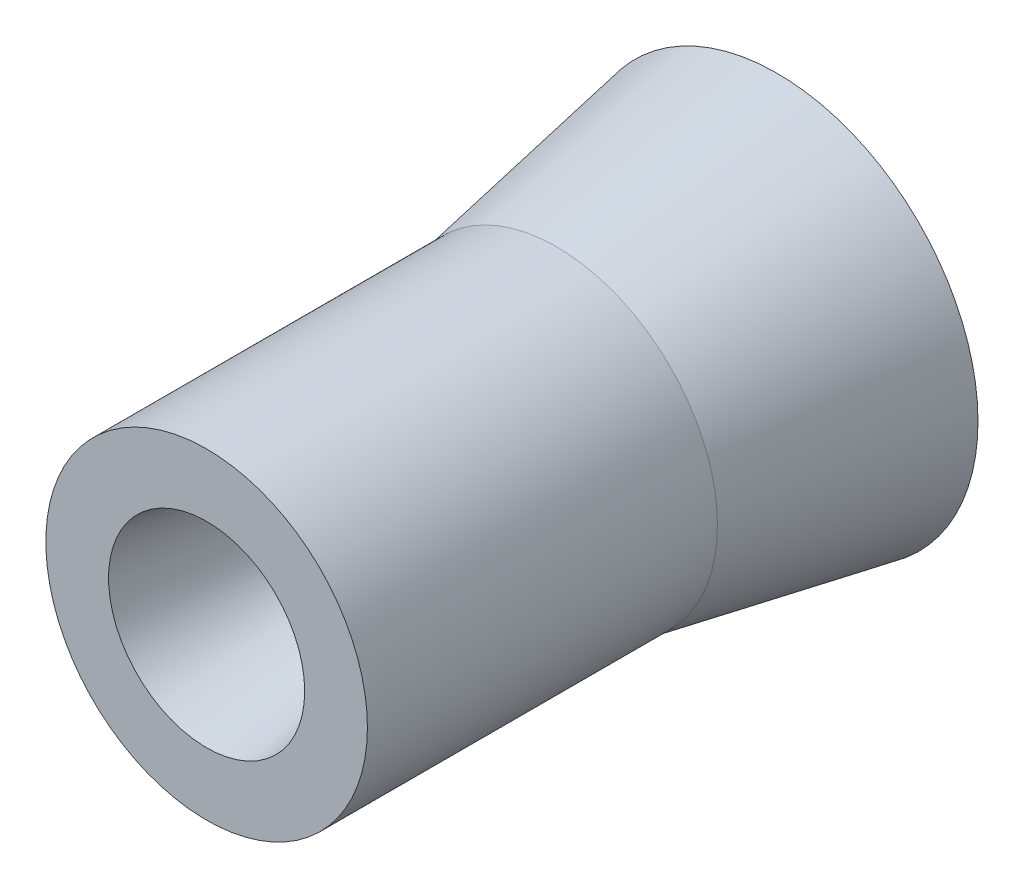
ISO-10303-21;
HEADER;
FILE_DESCRIPTION(('STEP AP214'),'2;1');
FILE_NAME('part.step','',(''),(''),'','','');
FILE_SCHEMA(('AUTOMOTIVE_DESIGN { 1 0 10303 214 1 1 1 1 }'));
ENDSEC;
DATA;
#1=APPLICATION_CONTEXT('core data for automotive mechanical design processes');
#2=APPLICATION_PROTOCOL_DEFINITION('international standard','automotive_design',2000,#1);
#3=PRODUCT_CONTEXT('',#1,'mechanical');
#4=PRODUCT('Part','Part','',(#3));
#5=PRODUCT_RELATED_PRODUCT_CATEGORY('part','',(#4));
#6=PRODUCT_DEFINITION_FORMATION('','',#4);
#7=PRODUCT_DEFINITION_CONTEXT('part definition',#1,'design');
#8=PRODUCT_DEFINITION('design','',#6,#7);
#9=PRODUCT_DEFINITION_SHAPE('','',#8);
#10=(LENGTH_UNIT() NAMED_UNIT(*) SI_UNIT(.MILLI.,.METRE.));
#11=(NAMED_UNIT(*) PLANE_ANGLE_UNIT() SI_UNIT($,.RADIAN.));
#12=(NAMED_UNIT(*) SI_UNIT($,.STERADIAN.) SOLID_ANGLE_UNIT());
#13=UNCERTAINTY_MEASURE_WITH_UNIT(LENGTH_MEASURE(1.E-05),#10,'distance_accuracy_value','');
#14=(GEOMETRIC_REPRESENTATION_CONTEXT(3) GLOBAL_UNCERTAINTY_ASSIGNED_CONTEXT((#13)) GLOBAL_UNIT_ASSIGNED_CONTEXT((#10,
#11,#12)) REPRESENTATION_CONTEXT('',''));
#15=CARTESIAN_POINT('',(0.,0.,0.));
#16=DIRECTION('',(0.,0.,1.));
#17=DIRECTION('',(1.,0.,0.));
#18=AXIS2_PLACEMENT_3D('',#15,#16,#17);
#19=CARTESIAN_POINT('',(0.,254.852892635509,-2898.72744706768));
#20=DIRECTION('',(0.,0.,-1.));
#21=DIRECTION('',(-1.,0.,0.));
#22=AXIS2_PLACEMENT_3D('',#19,#20,#21);
#23=CONICAL_SURFACE('',#22,163.693578985044,0.179853499792478);
#24=CARTESIAN_POINT('',(0.,254.852892635509,-2719.07011998567));
#25=DIRECTION('',(0.,0.,1.));
#26=DIRECTION('',(1.,0.,0.));
#27=AXIS2_PLACEMENT_3D('',#24,#25,#26);
#28=CIRCLE('',#27,131.028610424678);
#29=CARTESIAN_POINT('',(131.028610424678,254.852892635509,-2719.07011998567));
#30=VERTEX_POINT('',#29);
#31=EDGE_CURVE('E10',#30,#30,#28,.T.);
#32=ORIENTED_EDGE('',*,*,#31,.F.);
#33=EDGE_LOOP('',(#32));
#34=FACE_BOUND('',#33,.T.);
#35=CARTESIAN_POINT('',(0.,254.852892635509,-2898.72744706768));
#36=DIRECTION('',(0.,0.,1.));
#37=DIRECTION('',(1.,0.,0.));
#38=AXIS2_PLACEMENT_3D('',#35,#36,#37);
#39=CIRCLE('',#38,163.693578985044);
#40=CARTESIAN_POINT('',(163.693578985044,254.852892635509,-2898.72744706768));
#41=VERTEX_POINT('',#40);
#42=EDGE_CURVE('E63',#41,#41,#39,.T.);
#43=ORIENTED_EDGE('',*,*,#42,.T.);
#44=EDGE_LOOP('',(#43));
#45=FACE_BOUND('',#44,.T.);
#46=ADVANCED_FACE('F38',(#34,#45),#23,.T.);
#47=CARTESIAN_POINT('',(0.,254.852892635509,-1616.56539177459));
#48=DIRECTION('',(0.,0.,1.));
#49=DIRECTION('',(1.,0.,0.));
#50=AXIS2_PLACEMENT_3D('',#47,#48,#49);
#51=CYLINDRICAL_SURFACE('',#50,131.028610424678);
#52=CARTESIAN_POINT('',(0.,254.852892635509,-2433.82624691396));
#53=DIRECTION('',(0.,0.,1.));
#54=DIRECTION('',(1.,0.,0.));
#55=AXIS2_PLACEMENT_3D('',#52,#53,#54);
#56=CIRCLE('',#55,131.028610424678);
#57=CARTESIAN_POINT('',(131.028610424678,254.852892635509,-2433.82624691396));
#58=VERTEX_POINT('',#57);
#59=EDGE_CURVE('E44',#58,#58,#56,.T.);
#60=ORIENTED_EDGE('',*,*,#59,.F.);
#61=EDGE_LOOP('',(#60));
#62=FACE_BOUND('',#61,.T.);
#63=ORIENTED_EDGE('',*,*,#31,.T.);
#64=EDGE_LOOP('',(#63));
#65=FACE_BOUND('',#64,.T.);
#66=ADVANCED_FACE('F124',(#62,#65),#51,.T.);
#67=CARTESIAN_POINT('',(0.,375.881503060187,-2433.82624691396));
#68=DIRECTION('',(0.,0.,-1.));
#69=DIRECTION('',(-1.,0.,0.));
#70=AXIS2_PLACEMENT_3D('',#67,#68,#69);
#71=PLANE('',#70);
#72=CARTESIAN_POINT('',(0.,254.852892635509,-2433.82624691396));
#73=DIRECTION('',(0.,0.,1.));
#74=DIRECTION('',(1.,0.,0.));
#75=AXIS2_PLACEMENT_3D('',#72,#73,#74);
#76=CIRCLE('',#75,79.9184994133002);
#77=CARTESIAN_POINT('',(79.9184994133002,254.852892635509,-2433.82624691396));
#78=VERTEX_POINT('',#77);
#79=EDGE_CURVE('E48',#78,#78,#76,.T.);
#80=ORIENTED_EDGE('',*,*,#79,.F.);
#81=EDGE_LOOP('',(#80));
#82=FACE_BOUND('',#81,.T.);
#83=ORIENTED_EDGE('',*,*,#59,.T.);
#84=EDGE_LOOP('',(#83));
#85=FACE_BOUND('',#84,.T.);
#86=ADVANCED_FACE('F121',(#82,#85),#71,.F.);
#87=CARTESIAN_POINT('',(0.,254.852892635509,-2433.82624691396));
#88=DIRECTION('',(0.,0.,1.));
#89=DIRECTION('',(1.,0.,0.));
#90=AXIS2_PLACEMENT_3D('',#87,#88,#89);
#91=CONICAL_SURFACE('',#90,79.9184994133002,0.181092656531218);
#92=CARTESIAN_POINT('',(0.,254.852892635509,-2541.94019818034));
#93=DIRECTION('',(0.,0.,1.));
#94=DIRECTION('',(1.,0.,0.));
#95=AXIS2_PLACEMENT_3D('',#92,#93,#94);
#96=CIRCLE('',#95,60.1229872095971);
#97=CARTESIAN_POINT('',(60.1229872095971,254.852892635509,-2541.94019818034));
#98=VERTEX_POINT('',#97);
#99=EDGE_CURVE('E52',#98,#98,#96,.T.);
#100=ORIENTED_EDGE('',*,*,#99,.F.);
#101=EDGE_LOOP('',(#100));
#102=FACE_BOUND('',#101,.T.);
#103=ORIENTED_EDGE('',*,*,#79,.T.);
#104=EDGE_LOOP('',(#103));
#105=FACE_BOUND('',#104,.T.);
#106=ADVANCED_FACE('F117',(#102,#105),#91,.F.);
#107=CARTESIAN_POINT('',(0.,254.852892635509,-1616.56539177459));
#108=DIRECTION('',(0.,0.,1.));
#109=DIRECTION('',(1.,0.,0.));
#110=AXIS2_PLACEMENT_3D('',#107,#108,#109);
#111=CYLINDRICAL_SURFACE('',#110,60.1229872095971);
#112=CARTESIAN_POINT('',(0.,254.852892635509,-2735.52051683653));
#113=DIRECTION('',(0.,0.,1.));
#114=DIRECTION('',(1.,0.,0.));
#115=AXIS2_PLACEMENT_3D('',#112,#113,#114);
#116=CIRCLE('',#115,60.1229872095971);
#117=CARTESIAN_POINT('',(60.1229872095971,254.852892635509,-2735.52051683653));
#118=VERTEX_POINT('',#117);
#119=EDGE_CURVE('E57',#118,#118,#116,.T.);
#120=ORIENTED_EDGE('',*,*,#119,.F.);
#121=EDGE_LOOP('',(#120));
#122=FACE_BOUND('',#121,.T.);
#123=ORIENTED_EDGE('',*,*,#99,.T.);
#124=EDGE_LOOP('',(#123));
#125=FACE_BOUND('',#124,.T.);
#126=ADVANCED_FACE('F113',(#122,#125),#111,.F.);
#127=CARTESIAN_POINT('',(0.,254.852892635509,-2735.52051683653));
#128=DIRECTION('',(0.,0.,-1.));
#129=DIRECTION('',(-1.,0.,0.));
#130=AXIS2_PLACEMENT_3D('',#127,#128,#129);
#131=CONICAL_SURFACE('',#130,60.1229872095971,0.317691036777835);
#132=CARTESIAN_POINT('',(0.,254.852892635509,-2898.72744706768));
#133=DIRECTION('',(0.,0.,1.));
#134=DIRECTION('',(1.,0.,0.));
#135=AXIS2_PLACEMENT_3D('',#132,#133,#134);
#136=CIRCLE('',#135,113.790130934256);
#137=CARTESIAN_POINT('',(113.790130934256,254.852892635509,-2898.72744706768));
#138=VERTEX_POINT('',#137);
#139=EDGE_CURVE('E60',#138,#138,#136,.T.);
#140=ORIENTED_EDGE('',*,*,#139,.F.);
#141=EDGE_LOOP('',(#140));
#142=FACE_BOUND('',#141,.T.);
#143=ORIENTED_EDGE('',*,*,#119,.T.);
#144=EDGE_LOOP('',(#143));
#145=FACE_BOUND('',#144,.T.);
#146=ADVANCED_FACE('F109',(#142,#145),#131,.F.);
#147=CARTESIAN_POINT('',(0.,375.881503060187,-2898.72744706768));
#148=DIRECTION('',(0.,0.,1.));
#149=DIRECTION('',(1.,0.,0.));
#150=AXIS2_PLACEMENT_3D('',#147,#148,#149);
#151=PLANE('',#150);
#152=ORIENTED_EDGE('',*,*,#42,.F.);
#153=EDGE_LOOP('',(#152));
#154=FACE_BOUND('',#153,.T.);
#155=ORIENTED_EDGE('',*,*,#139,.T.);
#156=EDGE_LOOP('',(#155));
#157=FACE_BOUND('',#156,.T.);
#158=ADVANCED_FACE('F107',(#154,#157),#151,.F.);
#159=CLOSED_SHELL('',(#46,#66,#86,#106,#126,#146,#158));
#160=CARTESIAN_POINT('',(0.,254.852892635509,-2888.72744706768));
#161=DIRECTION('',(0.,0.,-1.));
#162=DIRECTION('',(-1.,0.,0.));
#163=AXIS2_PLACEMENT_3D('',#160,#161,#162);
#164=CONICAL_SURFACE('',#163,151.71145181459,0.179853499792478);
#165=CARTESIAN_POINT('',(0.,254.852892635509,-2719.97181942317));
#166=DIRECTION('',(0.,0.,1.));
#167=DIRECTION('',(1.,0.,0.));
#168=AXIS2_PLACEMENT_3D('',#165,#166,#167);
#169=CIRCLE('',#168,121.028610424678);
#170=CARTESIAN_POINT('',(121.028610424678,254.852892635509,-2719.97181942317));
#171=VERTEX_POINT('',#170);
#172=EDGE_CURVE('E66',#171,#171,#169,.T.);
#173=ORIENTED_EDGE('',*,*,#172,.T.);
#174=EDGE_LOOP('',(#173));
#175=FACE_BOUND('',#174,.T.);
#176=CARTESIAN_POINT('',(0.,254.852892635509,-2888.72744706768));
#177=DIRECTION('',(0.,0.,1.));
#178=DIRECTION('',(1.,0.,0.));
#179=AXIS2_PLACEMENT_3D('',#176,#177,#178);
#180=CIRCLE('',#179,151.71145181459);
#181=CARTESIAN_POINT('',(151.71145181459,254.852892635509,-2888.72744706768));
#182=VERTEX_POINT('',#181);
#183=EDGE_CURVE('E84',#182,#182,#180,.T.);
#184=ORIENTED_EDGE('',*,*,#183,.F.);
#185=EDGE_LOOP('',(#184));
#186=FACE_BOUND('',#185,.T.);
#187=ADVANCED_FACE('F91',(#175,#186),#164,.F.);
#188=CARTESIAN_POINT('',(0.,254.852892635509,-1616.56539177459));
#189=DIRECTION('',(0.,0.,1.));
#190=DIRECTION('',(1.,0.,0.));
#191=AXIS2_PLACEMENT_3D('',#188,#189,#190);
#192=CYLINDRICAL_SURFACE('',#191,121.028610424678);
#193=CARTESIAN_POINT('',(0.,254.852892635509,-2443.82624691396));
#194=DIRECTION('',(0.,0.,1.));
#195=DIRECTION('',(1.,0.,0.));
#196=AXIS2_PLACEMENT_3D('',#193,#194,#195);
#197=CIRCLE('',#196,121.028610424678);
#198=CARTESIAN_POINT('',(121.028610424678,254.852892635509,-2443.82624691396));
#199=VERTEX_POINT('',#198);
#200=EDGE_CURVE('E69',#199,#199,#197,.T.);
#201=ORIENTED_EDGE('',*,*,#200,.T.);
#202=EDGE_LOOP('',(#201));
#203=FACE_BOUND('',#202,.T.);
#204=ORIENTED_EDGE('',*,*,#172,.F.);
#205=EDGE_LOOP('',(#204));
#206=FACE_BOUND('',#205,.T.);
#207=ADVANCED_FACE('F93',(#203,#206),#192,.F.);
#208=CARTESIAN_POINT('',(0.,375.881503060187,-2443.82624691396));
#209=DIRECTION('',(0.,0.,-1.));
#210=DIRECTION('',(-1.,0.,0.));
#211=AXIS2_PLACEMENT_3D('',#208,#209,#210);
#212=PLANE('',#211);
#213=CARTESIAN_POINT('',(0.,254.852892635509,-2443.82624691396));
#214=DIRECTION('',(0.,0.,1.));
#215=DIRECTION('',(1.,0.,0.));
#216=AXIS2_PLACEMENT_3D('',#213,#214,#215);
#217=CIRCLE('',#216,88.2537571218177);
#218=CARTESIAN_POINT('',(88.2537571218177,254.852892635509,-2443.82624691396));
#219=VERTEX_POINT('',#218);
#220=EDGE_CURVE('E72',#219,#219,#217,.T.);
#221=ORIENTED_EDGE('',*,*,#220,.T.);
#222=EDGE_LOOP('',(#221));
#223=FACE_BOUND('',#222,.T.);
#224=ORIENTED_EDGE('',*,*,#200,.F.);
#225=EDGE_LOOP('',(#224));
#226=FACE_BOUND('',#225,.T.);
#227=ADVANCED_FACE('F101',(#223,#226),#212,.T.);
#228=CARTESIAN_POINT('',(0.,254.852892635509,-2443.82624691396));
#229=DIRECTION('',(0.,0.,1.));
#230=DIRECTION('',(1.,0.,0.));
#231=AXIS2_PLACEMENT_3D('',#228,#229,#230);
#232=CONICAL_SURFACE('',#231,88.2537571218177,0.181092656531218);
#233=CARTESIAN_POINT('',(0.,254.852892635509,-2542.84814412686));
#234=DIRECTION('',(0.,0.,1.));
#235=DIRECTION('',(1.,0.,0.));
#236=AXIS2_PLACEMENT_3D('',#233,#234,#235);
#237=CIRCLE('',#236,70.1229872095971);
#238=CARTESIAN_POINT('',(70.1229872095971,254.852892635509,-2542.84814412686));
#239=VERTEX_POINT('',#238);
#240=EDGE_CURVE('E75',#239,#239,#237,.T.);
#241=ORIENTED_EDGE('',*,*,#240,.T.);
#242=EDGE_LOOP('',(#241));
#243=FACE_BOUND('',#242,.T.);
#244=ORIENTED_EDGE('',*,*,#220,.F.);
#245=EDGE_LOOP('',(#244));
#246=FACE_BOUND('',#245,.T.);
#247=ADVANCED_FACE('F206',(#243,#246),#232,.T.);
#248=CARTESIAN_POINT('',(0.,254.852892635509,-1616.56539177459));
#249=DIRECTION('',(0.,0.,1.));
#250=DIRECTION('',(1.,0.,0.));
#251=AXIS2_PLACEMENT_3D('',#248,#249,#250);
#252=CYLINDRICAL_SURFACE('',#251,70.1229872095971);
#253=CARTESIAN_POINT('',(0.,254.852892635509,-2733.91856550949));
#254=DIRECTION('',(0.,0.,1.));
#255=DIRECTION('',(1.,0.,0.));
#256=AXIS2_PLACEMENT_3D('',#253,#254,#255);
#257=CIRCLE('',#256,70.1229872095971);
#258=CARTESIAN_POINT('',(70.1229872095971,254.852892635509,-2733.91856550949));
#259=VERTEX_POINT('',#258);
#260=EDGE_CURVE('E78',#259,#259,#257,.T.);
#261=ORIENTED_EDGE('',*,*,#260,.T.);
#262=EDGE_LOOP('',(#261));
#263=FACE_BOUND('',#262,.T.);
#264=ORIENTED_EDGE('',*,*,#240,.F.);
#265=EDGE_LOOP('',(#264));
#266=FACE_BOUND('',#265,.T.);
#267=ADVANCED_FACE('F216',(#263,#266),#252,.T.);
#268=CARTESIAN_POINT('',(0.,254.852892635509,-2733.91856550949));
#269=DIRECTION('',(0.,0.,-1.));
#270=DIRECTION('',(-1.,0.,0.));
#271=AXIS2_PLACEMENT_3D('',#268,#269,#270);
#272=CONICAL_SURFACE('',#271,70.1229872095971,0.317691036777835);
#273=CARTESIAN_POINT('',(0.,254.852892635509,-2888.72744706768));
#274=DIRECTION('',(0.,0.,1.));
#275=DIRECTION('',(1.,0.,0.));
#276=AXIS2_PLACEMENT_3D('',#273,#274,#275);
#277=CIRCLE('',#276,121.028610424678);
#278=CARTESIAN_POINT('',(121.028610424678,254.852892635509,-2888.72744706768));
#279=VERTEX_POINT('',#278);
#280=EDGE_CURVE('E81',#279,#279,#277,.T.);
#281=ORIENTED_EDGE('',*,*,#280,.T.);
#282=EDGE_LOOP('',(#281));
#283=FACE_BOUND('',#282,.T.);
#284=ORIENTED_EDGE('',*,*,#260,.F.);
#285=EDGE_LOOP('',(#284));
#286=FACE_BOUND('',#285,.T.);
#287=ADVANCED_FACE('F227',(#283,#286),#272,.T.);
#288=CARTESIAN_POINT('',(0.,375.881503060187,-2888.72744706768));
#289=DIRECTION('',(0.,0.,1.));
#290=DIRECTION('',(1.,0.,0.));
#291=AXIS2_PLACEMENT_3D('',#288,#289,#290);
#292=PLANE('',#291);
#293=ORIENTED_EDGE('',*,*,#183,.T.);
#294=EDGE_LOOP('',(#293));
#295=FACE_BOUND('',#294,.T.);
#296=ORIENTED_EDGE('',*,*,#280,.F.);
#297=EDGE_LOOP('',(#296));
#298=FACE_BOUND('',#297,.T.);
#299=ADVANCED_FACE('F88',(#295,#298),#292,.T.);
#300=CLOSED_SHELL('',(#187,#207,#227,#247,#267,#287,#299));
#301=ORIENTED_CLOSED_SHELL('',*,#300,.T.);
#302=BREP_WITH_VOIDS('B2',#159,(#301));
#303=ADVANCED_BREP_SHAPE_REPRESENTATION('',(#18,#302),#14);
#304=SHAPE_DEFINITION_REPRESENTATION(#9,#303);
ENDSEC;
END-ISO-10303-21;
